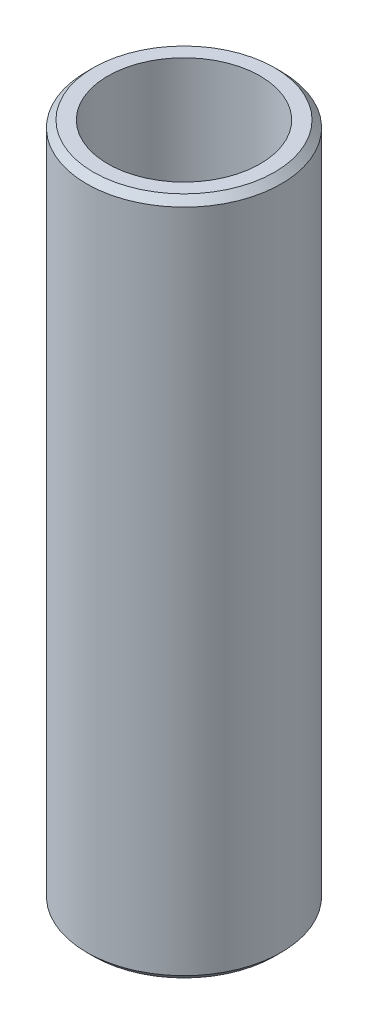
ISO-10303-21;
HEADER;
FILE_DESCRIPTION(('STEP AP214'),'2;1');
FILE_NAME('part.step','',(''),(''),'','','');
FILE_SCHEMA(('AUTOMOTIVE_DESIGN { 1 0 10303 214 1 1 1 1 }'));
ENDSEC;
DATA;
#1=APPLICATION_CONTEXT('core data for automotive mechanical design processes');
#2=APPLICATION_PROTOCOL_DEFINITION('international standard','automotive_design',2000,#1);
#3=PRODUCT_CONTEXT('',#1,'mechanical');
#4=PRODUCT('Part','Part','',(#3));
#5=PRODUCT_RELATED_PRODUCT_CATEGORY('part','',(#4));
#6=PRODUCT_DEFINITION_FORMATION('','',#4);
#7=PRODUCT_DEFINITION_CONTEXT('part definition',#1,'design');
#8=PRODUCT_DEFINITION('design','',#6,#7);
#9=PRODUCT_DEFINITION_SHAPE('','',#8);
#10=(LENGTH_UNIT() NAMED_UNIT(*) SI_UNIT(.MILLI.,.METRE.));
#11=(NAMED_UNIT(*) PLANE_ANGLE_UNIT() SI_UNIT($,.RADIAN.));
#12=(NAMED_UNIT(*) SI_UNIT($,.STERADIAN.) SOLID_ANGLE_UNIT());
#13=UNCERTAINTY_MEASURE_WITH_UNIT(LENGTH_MEASURE(1.E-05),#10,'distance_accuracy_value','');
#14=(GEOMETRIC_REPRESENTATION_CONTEXT(3) GLOBAL_UNCERTAINTY_ASSIGNED_CONTEXT((#13)) GLOBAL_UNIT_ASSIGNED_CONTEXT((#10,
#11,#12)) REPRESENTATION_CONTEXT('',''));
#15=CARTESIAN_POINT('',(0.,0.,0.));
#16=DIRECTION('',(0.,0.,1.));
#17=DIRECTION('',(1.,0.,0.));
#18=AXIS2_PLACEMENT_3D('',#15,#16,#17);
#19=CARTESIAN_POINT('',(0.,226.802007325555,0.));
#20=DIRECTION('',(0.,-1.,0.));
#21=DIRECTION('',(0.,0.,-1.));
#22=AXIS2_PLACEMENT_3D('',#19,#20,#21);
#23=CYLINDRICAL_SURFACE('',#22,32.5);
#24=CARTESIAN_POINT('',(0.,224.545719847262,0.));
#25=DIRECTION('',(0.,1.,0.));
#26=DIRECTION('',(0.,0.,1.));
#27=AXIS2_PLACEMENT_3D('',#24,#25,#26);
#28=CIRCLE('',#27,32.5);
#29=CARTESIAN_POINT('',(0.,224.545719847262,-32.5));
#30=VERTEX_POINT('',#29);
#31=EDGE_CURVE('E50',#30,#30,#28,.F.);
#32=CARTESIAN_POINT('',(0.,2.25628747829365,0.));
#33=DIRECTION('',(0.,1.,0.));
#34=DIRECTION('',(0.,0.,1.));
#35=AXIS2_PLACEMENT_3D('',#32,#33,#34);
#36=CIRCLE('',#35,32.5);
#37=CARTESIAN_POINT('',(0.,2.25628747829362,-32.5));
#38=VERTEX_POINT('',#37);
#39=EDGE_CURVE('E51',#38,#38,#36,.T.);
#40=CARTESIAN_POINT('',(0.,224.545719847262,-32.5));
#41=CARTESIAN_POINT('',(0.,222.230204926752,-32.5));
#42=CARTESIAN_POINT('',(0.,219.914690006242,-32.5));
#43=CARTESIAN_POINT('',(0.,215.283660165222,-32.5));
#44=CARTESIAN_POINT('',(0.,212.968145244712,-32.5));
#45=CARTESIAN_POINT('',(0.,208.337115403691,-32.5));
#46=CARTESIAN_POINT('',(0.,206.021600483181,-32.5));
#47=CARTESIAN_POINT('',(0.,201.390570642161,-32.5));
#48=CARTESIAN_POINT('',(0.,199.075055721651,-32.5));
#49=CARTESIAN_POINT('',(0.,194.444025880631,-32.5));
#50=CARTESIAN_POINT('',(0.,192.128510960121,-32.5));
#51=CARTESIAN_POINT('',(0.,187.497481119101,-32.5));
#52=CARTESIAN_POINT('',(0.,185.18196619859,-32.5));
#53=CARTESIAN_POINT('',(0.,180.55093635757,-32.5));
#54=CARTESIAN_POINT('',(0.,178.23542143706,-32.5));
#55=CARTESIAN_POINT('',(0.,173.60439159604,-32.5));
#56=CARTESIAN_POINT('',(0.,171.28887667553,-32.5));
#57=CARTESIAN_POINT('',(0.,166.65784683451,-32.5));
#58=CARTESIAN_POINT('',(0.,164.342331914,-32.5));
#59=CARTESIAN_POINT('',(0.,159.71130207298,-32.5));
#60=CARTESIAN_POINT('',(0.,157.395787152469,-32.5));
#61=CARTESIAN_POINT('',(0.,152.764757311449,-32.5));
#62=CARTESIAN_POINT('',(0.,150.449242390939,-32.5));
#63=CARTESIAN_POINT('',(0.,145.818212549919,-32.5));
#64=CARTESIAN_POINT('',(0.,143.502697629409,-32.5));
#65=CARTESIAN_POINT('',(0.,138.871667788389,-32.5));
#66=CARTESIAN_POINT('',(0.,136.556152867879,-32.5));
#67=CARTESIAN_POINT('',(0.,131.925123026859,-32.5));
#68=CARTESIAN_POINT('',(0.,129.609608106348,-32.5));
#69=CARTESIAN_POINT('',(0.,124.978578265328,-32.5));
#70=CARTESIAN_POINT('',(0.,122.663063344818,-32.5));
#71=CARTESIAN_POINT('',(0.,118.032033503798,-32.5));
#72=CARTESIAN_POINT('',(0.,115.716518583288,-32.5));
#73=CARTESIAN_POINT('',(0.,111.085488742268,-32.5));
#74=CARTESIAN_POINT('',(0.,108.769973821758,-32.5));
#75=CARTESIAN_POINT('',(0.,104.138943980737,-32.5));
#76=CARTESIAN_POINT('',(0.,101.823429060227,-32.5));
#77=CARTESIAN_POINT('',(0.,97.1923992192072,-32.5));
#78=CARTESIAN_POINT('',(0.,94.8768842986971,-32.5));
#79=CARTESIAN_POINT('',(0.,90.2458544576769,-32.5));
#80=CARTESIAN_POINT('',(0.,87.9303395371668,-32.5));
#81=CARTESIAN_POINT('',(0.,83.2993096961467,-32.5));
#82=CARTESIAN_POINT('',(0.,80.9837947756366,-32.5));
#83=CARTESIAN_POINT('',(0.,76.3527649346164,-32.5));
#84=CARTESIAN_POINT('',(0.,74.0372500141063,-32.5));
#85=CARTESIAN_POINT('',(0.,69.4062201730861,-32.5));
#86=CARTESIAN_POINT('',(0.,67.0907052525761,-32.5));
#87=CARTESIAN_POINT('',(0.,62.4596754115559,-32.5));
#88=CARTESIAN_POINT('',(0.,60.1441604910458,-32.5));
#89=CARTESIAN_POINT('',(0.,55.5131306500256,-32.5));
#90=CARTESIAN_POINT('',(0.,53.1976157295155,-32.5));
#91=CARTESIAN_POINT('',(0.,48.5665858884954,-32.5));
#92=CARTESIAN_POINT('',(0.,46.2510709679853,-32.5));
#93=CARTESIAN_POINT('',(0.,41.6200411269651,-32.5));
#94=CARTESIAN_POINT('',(0.,39.304526206455,-32.5));
#95=CARTESIAN_POINT('',(0.,34.6734963654348,-32.5));
#96=CARTESIAN_POINT('',(0.,32.3579814449248,-32.5));
#97=CARTESIAN_POINT('',(0.,27.7269516039046,-32.5));
#98=CARTESIAN_POINT('',(0.,25.4114366833945,-32.5));
#99=CARTESIAN_POINT('',(0.,20.7804068423743,-32.5));
#100=CARTESIAN_POINT('',(0.,18.4648919218642,-32.5));
#101=CARTESIAN_POINT('',(0.,13.833862080844,-32.5));
#102=CARTESIAN_POINT('',(0.,11.518347160334,-32.5));
#103=CARTESIAN_POINT('',(0.,6.88731731931379,-32.5));
#104=CARTESIAN_POINT('',(0.,4.57180239880371,-32.5));
#105=CARTESIAN_POINT('',(0.,2.25628747829362,-32.5));
#106=B_SPLINE_CURVE_WITH_KNOTS('',3,(#40,#41,#42,#43,#44,#45,#46,#47,#48,#49,#50,#51,#52,#53,
#54,#55,#56,#57,#58,#59,#60,#61,#62,#63,#64,#65,#66,#67,#68,#69,#70,#71,#72,#73,#74,#75,#76,#77,
#78,#79,#80,#81,#82,#83,#84,#85,#86,#87,#88,#89,#90,#91,#92,#93,#94,#95,#96,#97,#98,#99,#100,
#101,#102,#103,#104,#105),.UNSPECIFIED.,.F.,.F.,(4,2,2,2,2,2,2,2,2,2,2,2,2,2,2,2,2,2,2,2,2,2,2,
2,2,2,2,2,2,2,2,2,4),(0.,6.94654476153025,13.8930895230605,20.8396342845908,27.786179046121,
34.7327238076513,41.6792685691816,48.6258133307118,55.5723580922421,62.5189028537723,
69.4654476153026,76.4119923768329,83.3585371383631,90.3050818998934,97.2516266614236,
104.198171422954,111.144716184484,118.091260946014,125.037805707545,131.984350469075,
138.930895230605,145.877439992135,152.823984753666,159.770529515196,166.717074276726,
173.663619038256,180.610163799787,187.556708561317,194.503253322847,201.449798084378,
208.396342845908,215.342887607438,222.289432368968),.UNSPECIFIED.);
#107=EDGE_CURVE('BSEAM39',#30,#38,#106,.T.);
#108=ORIENTED_EDGE('',*,*,#31,.T.);
#109=ORIENTED_EDGE('',*,*,#39,.T.);
#110=ORIENTED_EDGE('',*,*,#107,.T.);
#111=ORIENTED_EDGE('',*,*,#107,.F.);
#112=EDGE_LOOP('',(#108,#110,#109,#111));
#113=FACE_BOUND('',#112,.T.);
#114=ADVANCED_FACE('F39',(#113),#23,.T.);
#115=CARTESIAN_POINT('',(0.,226.802007325555,0.));
#116=DIRECTION('',(0.,1.,0.));
#117=DIRECTION('',(0.,0.,1.));
#118=AXIS2_PLACEMENT_3D('',#115,#116,#117);
#119=PLANE('',#118);
#120=CARTESIAN_POINT('',(0.,226.802007325555,0.));
#121=DIRECTION('',(0.,1.,0.));
#122=DIRECTION('',(0.,0.,1.));
#123=AXIS2_PLACEMENT_3D('',#120,#121,#122);
#124=CIRCLE('',#123,30.2437125217066);
#125=CARTESIAN_POINT('',(0.,226.802007325555,30.2437125217066));
#126=VERTEX_POINT('',#125);
#127=EDGE_CURVE('E54',#126,#126,#124,.T.);
#128=ORIENTED_EDGE('',*,*,#127,.T.);
#129=EDGE_LOOP('',(#128));
#130=FACE_BOUND('',#129,.T.);
#131=CARTESIAN_POINT('',(0.,226.802007325555,0.));
#132=DIRECTION('',(0.,1.,0.));
#133=DIRECTION('',(0.,0.,1.));
#134=AXIS2_PLACEMENT_3D('',#131,#132,#133);
#135=CIRCLE('',#134,25.4405918622057);
#136=CARTESIAN_POINT('',(0.,226.802007325555,-25.4405918622057));
#137=VERTEX_POINT('',#136);
#138=EDGE_CURVE('E58',#137,#137,#135,.T.);
#139=ORIENTED_EDGE('',*,*,#138,.F.);
#140=EDGE_LOOP('',(#139));
#141=FACE_BOUND('',#140,.T.);
#142=ADVANCED_FACE('F69',(#130,#141),#119,.T.);
#143=CARTESIAN_POINT('',(0.,0.,0.));
#144=DIRECTION('',(0.,1.,0.));
#145=DIRECTION('',(0.,0.,1.));
#146=AXIS2_PLACEMENT_3D('',#143,#144,#145);
#147=PLANE('',#146);
#148=CARTESIAN_POINT('',(0.,0.,0.));
#149=DIRECTION('',(0.,1.,0.));
#150=DIRECTION('',(0.,0.,1.));
#151=AXIS2_PLACEMENT_3D('',#148,#149,#150);
#152=CIRCLE('',#151,30.2437125217063);
#153=CARTESIAN_POINT('',(0.,0.,30.2437125217063));
#154=VERTEX_POINT('',#153);
#155=EDGE_CURVE('E10',#154,#154,#152,.F.);
#156=ORIENTED_EDGE('',*,*,#155,.T.);
#157=EDGE_LOOP('',(#156));
#158=FACE_BOUND('',#157,.T.);
#159=CARTESIAN_POINT('',(0.,0.,0.));
#160=DIRECTION('',(0.,1.,0.));
#161=DIRECTION('',(0.,0.,1.));
#162=AXIS2_PLACEMENT_3D('',#159,#160,#161);
#163=CIRCLE('',#162,25.4405918622057);
#164=CARTESIAN_POINT('',(0.,0.,-25.4405918622057));
#165=VERTEX_POINT('',#164);
#166=EDGE_CURVE('E63',#165,#165,#163,.T.);
#167=ORIENTED_EDGE('',*,*,#166,.T.);
#168=EDGE_LOOP('',(#167));
#169=FACE_BOUND('',#168,.T.);
#170=ADVANCED_FACE('F75',(#158,#169),#147,.F.);
#171=CARTESIAN_POINT('',(0.,226.802007325555,0.));
#172=DIRECTION('',(0.,-1.,0.));
#173=DIRECTION('',(0.,0.,-1.));
#174=AXIS2_PLACEMENT_3D('',#171,#172,#173);
#175=CYLINDRICAL_SURFACE('',#174,25.4405918622057);
#176=CARTESIAN_POINT('',(0.,226.802007325555,-25.4405918622057));
#177=CARTESIAN_POINT('',(0.,224.439486415914,-25.4405918622057));
#178=CARTESIAN_POINT('',(0.,222.076965506273,-25.4405918622057));
#179=CARTESIAN_POINT('',(0.,217.351923686991,-25.4405918622057));
#180=CARTESIAN_POINT('',(0.,214.989402777349,-25.4405918622057));
#181=CARTESIAN_POINT('',(0.,210.264360958067,-25.4405918622057));
#182=CARTESIAN_POINT('',(0.,207.901840048426,-25.4405918622057));
#183=CARTESIAN_POINT('',(0.,203.176798229143,-25.4405918622057));
#184=CARTESIAN_POINT('',(0.,200.814277319502,-25.4405918622057));
#185=CARTESIAN_POINT('',(0.,196.08923550022,-25.4405918622057));
#186=CARTESIAN_POINT('',(0.,193.726714590579,-25.4405918622057));
#187=CARTESIAN_POINT('',(0.,189.001672771296,-25.4405918622057));
#188=CARTESIAN_POINT('',(0.,186.639151861655,-25.4405918622057));
#189=CARTESIAN_POINT('',(0.,181.914110042373,-25.4405918622057));
#190=CARTESIAN_POINT('',(0.,179.551589132731,-25.4405918622057));
#191=CARTESIAN_POINT('',(0.,174.826547313449,-25.4405918622057));
#192=CARTESIAN_POINT('',(0.,172.464026403808,-25.4405918622057));
#193=CARTESIAN_POINT('',(0.,167.738984584525,-25.4405918622057));
#194=CARTESIAN_POINT('',(0.,165.376463674884,-25.4405918622057));
#195=CARTESIAN_POINT('',(0.,160.651421855602,-25.4405918622057));
#196=CARTESIAN_POINT('',(0.,158.288900945961,-25.4405918622057));
#197=CARTESIAN_POINT('',(0.,153.563859126678,-25.4405918622057));
#198=CARTESIAN_POINT('',(0.,151.201338217037,-25.4405918622057));
#199=CARTESIAN_POINT('',(0.,146.476296397755,-25.4405918622057));
#200=CARTESIAN_POINT('',(0.,144.113775488113,-25.4405918622057));
#201=CARTESIAN_POINT('',(0.,139.388733668831,-25.4405918622057));
#202=CARTESIAN_POINT('',(0.,137.02621275919,-25.4405918622057));
#203=CARTESIAN_POINT('',(0.,132.301170939907,-25.4405918622057));
#204=CARTESIAN_POINT('',(0.,129.938650030266,-25.4405918622057));
#205=CARTESIAN_POINT('',(0.,125.213608210984,-25.4405918622057));
#206=CARTESIAN_POINT('',(0.,122.851087301342,-25.4405918622057));
#207=CARTESIAN_POINT('',(0.,118.12604548206,-25.4405918622057));
#208=CARTESIAN_POINT('',(0.,115.763524572419,-25.4405918622057));
#209=CARTESIAN_POINT('',(0.,111.038482753136,-25.4405918622057));
#210=CARTESIAN_POINT('',(0.,108.675961843495,-25.4405918622057));
#211=CARTESIAN_POINT('',(0.,103.950920024213,-25.4405918622057));
#212=CARTESIAN_POINT('',(0.,101.588399114572,-25.4405918622057));
#213=CARTESIAN_POINT('',(0.,96.8633572952893,-25.4405918622057));
#214=CARTESIAN_POINT('',(0.,94.5008363856481,-25.4405918622057));
#215=CARTESIAN_POINT('',(0.,89.7757945663657,-25.4405918622057));
#216=CARTESIAN_POINT('',(0.,87.4132736567245,-25.4405918622057));
#217=CARTESIAN_POINT('',(0.,82.6882318374421,-25.4405918622057));
#218=CARTESIAN_POINT('',(0.,80.3257109278009,-25.4405918622057));
#219=CARTESIAN_POINT('',(0.,75.6006691085185,-25.4405918622057));
#220=CARTESIAN_POINT('',(0.,73.2381481988773,-25.4405918622057));
#221=CARTESIAN_POINT('',(0.,68.5131063795948,-25.4405918622057));
#222=CARTESIAN_POINT('',(0.,66.1505854699536,-25.4405918622057));
#223=CARTESIAN_POINT('',(0.,61.4255436506712,-25.4405918622057));
#224=CARTESIAN_POINT('',(0.,59.06302274103,-25.4405918622057));
#225=CARTESIAN_POINT('',(0.,54.3379809217476,-25.4405918622057));
#226=CARTESIAN_POINT('',(0.,51.9754600121064,-25.4405918622057));
#227=CARTESIAN_POINT('',(0.,47.250418192824,-25.4405918622057));
#228=CARTESIAN_POINT('',(0.,44.8878972831828,-25.4405918622057));
#229=CARTESIAN_POINT('',(0.,40.1628554639004,-25.4405918622057));
#230=CARTESIAN_POINT('',(0.,37.8003345542592,-25.4405918622057));
#231=CARTESIAN_POINT('',(0.,33.0752927349768,-25.4405918622057));
#232=CARTESIAN_POINT('',(0.,30.7127718253356,-25.4405918622057));
#233=CARTESIAN_POINT('',(0.,25.9877300060532,-25.4405918622057));
#234=CARTESIAN_POINT('',(0.,23.625209096412,-25.4405918622057));
#235=CARTESIAN_POINT('',(0.,18.9001672771296,-25.4405918622057));
#236=CARTESIAN_POINT('',(0.,16.5376463674884,-25.4405918622057));
#237=CARTESIAN_POINT('',(0.,11.812604548206,-25.4405918622057));
#238=CARTESIAN_POINT('',(0.,9.45008363856478,-25.4405918622057));
#239=CARTESIAN_POINT('',(0.,4.72504181928238,-25.4405918622057));
#240=CARTESIAN_POINT('',(0.,2.36252090964117,-25.4405918622057));
#241=CARTESIAN_POINT('',(0.,0.,-25.4405918622057));
#242=B_SPLINE_CURVE_WITH_KNOTS('',3,(#176,#177,#178,#179,#180,#181,#182,#183,#184,#185,#186,
#187,#188,#189,#190,#191,#192,#193,#194,#195,#196,#197,#198,#199,#200,#201,#202,#203,#204,#205,
#206,#207,#208,#209,#210,#211,#212,#213,#214,#215,#216,#217,#218,#219,#220,#221,#222,#223,#224,
#225,#226,#227,#228,#229,#230,#231,#232,#233,#234,#235,#236,#237,#238,#239,#240,#241),
.UNSPECIFIED.,.F.,.F.,(4,2,2,2,2,2,2,2,2,2,2,2,2,2,2,2,2,2,2,2,2,2,2,2,2,2,2,2,2,2,2,2,4),(0.,
7.08756272892361,14.1751254578472,21.2626881867708,28.3502509156944,35.437813644618,
42.5253763735416,49.6129391024653,56.7005018313889,63.7880645603125,70.8756272892361,
77.9631900181597,85.0507527470833,92.1383154760069,99.2258782049305,106.313440933854,
113.401003662778,120.488566391701,127.576129120625,134.663691849549,141.751254578472,
148.838817307396,155.926380036319,163.013942765243,170.101505494167,177.18906822309,
184.276630952014,191.364193680937,198.451756409861,205.539319138785,212.626881867708,
219.714444596632,226.802007325555),.UNSPECIFIED.);
#243=EDGE_CURVE('BSEAM70',#137,#165,#242,.T.);
#244=ORIENTED_EDGE('',*,*,#138,.T.);
#245=ORIENTED_EDGE('',*,*,#166,.F.);
#246=ORIENTED_EDGE('',*,*,#243,.T.);
#247=ORIENTED_EDGE('',*,*,#243,.F.);
#248=EDGE_LOOP('',(#244,#246,#245,#247));
#249=FACE_BOUND('',#248,.T.);
#250=ADVANCED_FACE('F70',(#249),#175,.F.);
#251=CARTESIAN_POINT('',(0.,226.802007325555,0.));
#252=DIRECTION('',(0.,-1.,0.));
#253=DIRECTION('',(0.,0.,-1.));
#254=AXIS2_PLACEMENT_3D('',#251,#252,#253);
#255=CONICAL_SURFACE('',#254,30.2437125217066,0.78539816339745);
#256=ORIENTED_EDGE('',*,*,#31,.F.);
#257=EDGE_LOOP('',(#256));
#258=FACE_BOUND('',#257,.T.);
#259=ORIENTED_EDGE('',*,*,#127,.F.);
#260=EDGE_LOOP('',(#259));
#261=FACE_BOUND('',#260,.T.);
#262=ADVANCED_FACE('F81',(#258,#261),#255,.T.);
#263=CARTESIAN_POINT('',(0.,2.25628747829365,0.));
#264=DIRECTION('',(0.,1.,0.));
#265=DIRECTION('',(0.,0.,1.));
#266=AXIS2_PLACEMENT_3D('',#263,#264,#265);
#267=CONICAL_SURFACE('',#266,32.5,0.785398163397454);
#268=ORIENTED_EDGE('',*,*,#155,.F.);
#269=EDGE_LOOP('',(#268));
#270=FACE_BOUND('',#269,.T.);
#271=ORIENTED_EDGE('',*,*,#39,.F.);
#272=EDGE_LOOP('',(#271));
#273=FACE_BOUND('',#272,.T.);
#274=ADVANCED_FACE('F45',(#270,#273),#267,.T.);
#275=CLOSED_SHELL('',(#114,#142,#170,#250,#262,#274));
#276=MANIFOLD_SOLID_BREP('B2',#275);
#277=ADVANCED_BREP_SHAPE_REPRESENTATION('',(#18,#276),#14);
#278=SHAPE_DEFINITION_REPRESENTATION(#9,#277);
ENDSEC;
END-ISO-10303-21;
